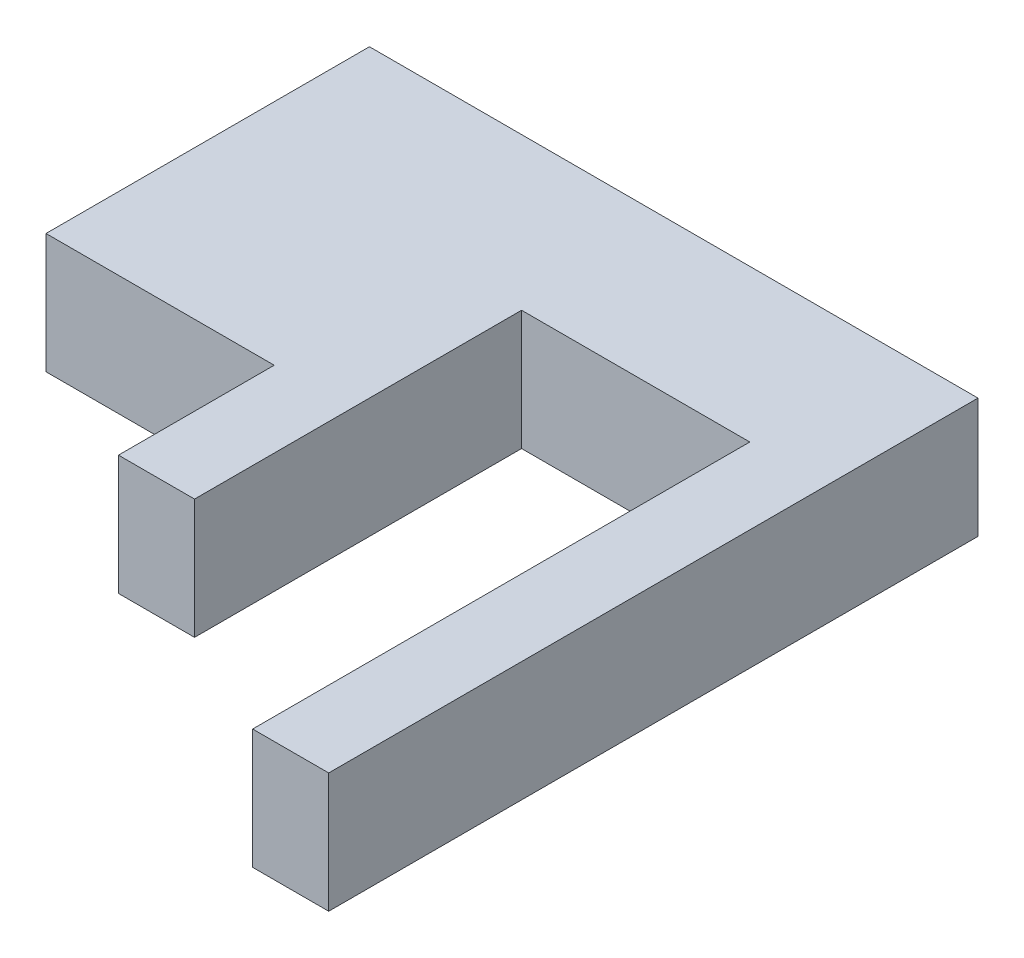
ISO-10303-21;
HEADER;
FILE_DESCRIPTION(('STEP AP214'),'2;1');
FILE_NAME('part.step','',(''),(''),'','','');
FILE_SCHEMA(('AUTOMOTIVE_DESIGN { 1 0 10303 214 1 1 1 1 }'));
ENDSEC;
DATA;
#1=APPLICATION_CONTEXT('core data for automotive mechanical design processes');
#2=APPLICATION_PROTOCOL_DEFINITION('international standard','automotive_design',2000,#1);
#3=PRODUCT_CONTEXT('',#1,'mechanical');
#4=PRODUCT('Part','Part','',(#3));
#5=PRODUCT_RELATED_PRODUCT_CATEGORY('part','',(#4));
#6=PRODUCT_DEFINITION_FORMATION('','',#4);
#7=PRODUCT_DEFINITION_CONTEXT('part definition',#1,'design');
#8=PRODUCT_DEFINITION('design','',#6,#7);
#9=PRODUCT_DEFINITION_SHAPE('','',#8);
#10=(LENGTH_UNIT() NAMED_UNIT(*) SI_UNIT(.MILLI.,.METRE.));
#11=(NAMED_UNIT(*) PLANE_ANGLE_UNIT() SI_UNIT($,.RADIAN.));
#12=(NAMED_UNIT(*) SI_UNIT($,.STERADIAN.) SOLID_ANGLE_UNIT());
#13=UNCERTAINTY_MEASURE_WITH_UNIT(LENGTH_MEASURE(1.E-05),#10,'distance_accuracy_value','');
#14=(GEOMETRIC_REPRESENTATION_CONTEXT(3) GLOBAL_UNCERTAINTY_ASSIGNED_CONTEXT((#13)) GLOBAL_UNIT_ASSIGNED_CONTEXT((#10,
#11,#12)) REPRESENTATION_CONTEXT('',''));
#15=CARTESIAN_POINT('',(0.,0.,0.));
#16=DIRECTION('',(0.,0.,1.));
#17=DIRECTION('',(1.,0.,0.));
#18=AXIS2_PLACEMENT_3D('',#15,#16,#17);
#19=CARTESIAN_POINT('',(-111.210993035549,10.,-33.624609368075));
#20=DIRECTION('',(1.,0.,0.));
#21=DIRECTION('',(0.,0.,-1.));
#22=AXIS2_PLACEMENT_3D('',#19,#20,#21);
#23=PLANE('',#22);
#24=DIRECTION('',(0.,0.,1.));
#25=VECTOR('',#24,1.);
#26=CARTESIAN_POINT('',(-111.210993035549,0.,-33.624609368075));
#27=LINE('',#26,#25);
#28=CARTESIAN_POINT('',(-111.210993035549,0.,-33.624609368075));
#29=VERTEX_POINT('',#28);
#30=CARTESIAN_POINT('',(-111.210993035549,0.,-6.62460936807503));
#31=VERTEX_POINT('',#30);
#32=EDGE_CURVE('E142',#29,#31,#27,.T.);
#33=ORIENTED_EDGE('',*,*,#32,.T.);
#34=DIRECTION('',(0.,-1.,0.));
#35=VECTOR('',#34,1.);
#36=CARTESIAN_POINT('',(-111.210993035549,10.,-6.62460936807503));
#37=LINE('',#36,#35);
#38=CARTESIAN_POINT('',(-111.210993035549,10.,-6.62460936807503));
#39=VERTEX_POINT('',#38);
#40=EDGE_CURVE('E11',#39,#31,#37,.T.);
#41=ORIENTED_EDGE('',*,*,#40,.F.);
#42=DIRECTION('',(0.,0.,1.));
#43=VECTOR('',#42,1.);
#44=CARTESIAN_POINT('',(-111.210993035549,10.,-33.624609368075));
#45=LINE('',#44,#43);
#46=CARTESIAN_POINT('',(-111.210993035549,10.,-33.624609368075));
#47=VERTEX_POINT('',#46);
#48=EDGE_CURVE('E161',#47,#39,#45,.T.);
#49=ORIENTED_EDGE('',*,*,#48,.F.);
#50=DIRECTION('',(0.,-1.,0.));
#51=VECTOR('',#50,1.);
#52=CARTESIAN_POINT('',(-111.210993035549,10.,-33.624609368075));
#53=LINE('',#52,#51);
#54=EDGE_CURVE('E138',#47,#29,#53,.T.);
#55=ORIENTED_EDGE('',*,*,#54,.T.);
#56=EDGE_LOOP('',(#33,#41,#49,#55));
#57=FACE_BOUND('',#56,.T.);
#58=ADVANCED_FACE('F33',(#57),#23,.F.);
#59=CARTESIAN_POINT('',(-111.210993035549,10.,-6.62460936807503));
#60=DIRECTION('',(0.,0.,-1.));
#61=DIRECTION('',(-1.,0.,0.));
#62=AXIS2_PLACEMENT_3D('',#59,#60,#61);
#63=PLANE('',#62);
#64=DIRECTION('',(1.,0.,0.));
#65=VECTOR('',#64,1.);
#66=CARTESIAN_POINT('',(-111.210993035549,0.,-6.62460936807503));
#67=LINE('',#66,#65);
#68=CARTESIAN_POINT('',(-92.1609930355495,0.,-6.62460936807503));
#69=VERTEX_POINT('',#68);
#70=EDGE_CURVE('E145',#31,#69,#67,.T.);
#71=ORIENTED_EDGE('',*,*,#70,.T.);
#72=DIRECTION('',(0.,-1.,0.));
#73=VECTOR('',#72,1.);
#74=CARTESIAN_POINT('',(-92.1609930355495,10.,-6.62460936807503));
#75=LINE('',#74,#73);
#76=CARTESIAN_POINT('',(-92.1609930355495,10.,-6.62460936807503));
#77=VERTEX_POINT('',#76);
#78=EDGE_CURVE('E41',#77,#69,#75,.T.);
#79=ORIENTED_EDGE('',*,*,#78,.F.);
#80=DIRECTION('',(1.,0.,0.));
#81=VECTOR('',#80,1.);
#82=CARTESIAN_POINT('',(-111.210993035549,10.,-6.62460936807503));
#83=LINE('',#82,#81);
#84=EDGE_CURVE('E95',#39,#77,#83,.T.);
#85=ORIENTED_EDGE('',*,*,#84,.F.);
#86=ORIENTED_EDGE('',*,*,#40,.T.);
#87=EDGE_LOOP('',(#71,#79,#85,#86));
#88=FACE_BOUND('',#87,.T.);
#89=ADVANCED_FACE('F208',(#88),#63,.F.);
#90=CARTESIAN_POINT('',(-92.1609930355495,10.,6.37539063192497));
#91=DIRECTION('',(1.,0.,0.));
#92=DIRECTION('',(0.,0.,-1.));
#93=AXIS2_PLACEMENT_3D('',#90,#91,#92);
#94=PLANE('',#93);
#95=DIRECTION('',(0.,0.,1.));
#96=VECTOR('',#95,1.);
#97=CARTESIAN_POINT('',(-92.1609930355495,0.,6.37539063192497));
#98=LINE('',#97,#96);
#99=CARTESIAN_POINT('',(-92.1609930355495,0.,6.37539063192497));
#100=VERTEX_POINT('',#99);
#101=EDGE_CURVE('E147',#69,#100,#98,.T.);
#102=ORIENTED_EDGE('',*,*,#101,.T.);
#103=DIRECTION('',(0.,-1.,0.));
#104=VECTOR('',#103,1.);
#105=CARTESIAN_POINT('',(-92.1609930355495,10.,6.37539063192497));
#106=LINE('',#105,#104);
#107=CARTESIAN_POINT('',(-92.1609930355495,10.,6.37539063192497));
#108=VERTEX_POINT('',#107);
#109=EDGE_CURVE('E174',#108,#100,#106,.T.);
#110=ORIENTED_EDGE('',*,*,#109,.F.);
#111=DIRECTION('',(0.,0.,1.));
#112=VECTOR('',#111,1.);
#113=CARTESIAN_POINT('',(-92.1609930355495,10.,6.37539063192497));
#114=LINE('',#113,#112);
#115=EDGE_CURVE('E182',#77,#108,#114,.T.);
#116=ORIENTED_EDGE('',*,*,#115,.F.);
#117=ORIENTED_EDGE('',*,*,#78,.T.);
#118=EDGE_LOOP('',(#102,#110,#116,#117));
#119=FACE_BOUND('',#118,.T.);
#120=ADVANCED_FACE('F180',(#119),#94,.F.);
#121=CARTESIAN_POINT('',(-92.1609930355495,10.,6.37539063192497));
#122=DIRECTION('',(0.,0.,-1.));
#123=DIRECTION('',(-1.,0.,0.));
#124=AXIS2_PLACEMENT_3D('',#121,#122,#123);
#125=PLANE('',#124);
#126=DIRECTION('',(1.,0.,0.));
#127=VECTOR('',#126,1.);
#128=CARTESIAN_POINT('',(-92.1609930355495,0.,6.37539063192497));
#129=LINE('',#128,#127);
#130=CARTESIAN_POINT('',(-85.8109930355495,0.,6.37539063192497));
#131=VERTEX_POINT('',#130);
#132=EDGE_CURVE('E149',#100,#131,#129,.T.);
#133=ORIENTED_EDGE('',*,*,#132,.T.);
#134=DIRECTION('',(0.,-1.,0.));
#135=VECTOR('',#134,1.);
#136=CARTESIAN_POINT('',(-85.8109930355495,10.,6.37539063192497));
#137=LINE('',#136,#135);
#138=CARTESIAN_POINT('',(-85.8109930355495,10.,6.37539063192497));
#139=VERTEX_POINT('',#138);
#140=EDGE_CURVE('E171',#139,#131,#137,.T.);
#141=ORIENTED_EDGE('',*,*,#140,.F.);
#142=DIRECTION('',(1.,0.,0.));
#143=VECTOR('',#142,1.);
#144=CARTESIAN_POINT('',(-92.1609930355495,10.,6.37539063192497));
#145=LINE('',#144,#143);
#146=EDGE_CURVE('E198',#108,#139,#145,.T.);
#147=ORIENTED_EDGE('',*,*,#146,.F.);
#148=ORIENTED_EDGE('',*,*,#109,.T.);
#149=EDGE_LOOP('',(#133,#141,#147,#148));
#150=FACE_BOUND('',#149,.T.);
#151=ADVANCED_FACE('F189',(#150),#125,.F.);
#152=CARTESIAN_POINT('',(-85.8109930355495,10.,-20.924609368075));
#153=DIRECTION('',(-1.,0.,0.));
#154=DIRECTION('',(0.,0.,1.));
#155=AXIS2_PLACEMENT_3D('',#152,#153,#154);
#156=PLANE('',#155);
#157=DIRECTION('',(0.,0.,-1.));
#158=VECTOR('',#157,1.);
#159=CARTESIAN_POINT('',(-85.8109930355495,0.,-20.924609368075));
#160=LINE('',#159,#158);
#161=CARTESIAN_POINT('',(-85.8109930355495,0.,-20.924609368075));
#162=VERTEX_POINT('',#161);
#163=EDGE_CURVE('E151',#131,#162,#160,.T.);
#164=ORIENTED_EDGE('',*,*,#163,.T.);
#165=DIRECTION('',(0.,-1.,0.));
#166=VECTOR('',#165,1.);
#167=CARTESIAN_POINT('',(-85.8109930355495,10.,-20.924609368075));
#168=LINE('',#167,#166);
#169=CARTESIAN_POINT('',(-85.8109930355495,10.,-20.924609368075));
#170=VERTEX_POINT('',#169);
#171=EDGE_CURVE('E168',#170,#162,#168,.T.);
#172=ORIENTED_EDGE('',*,*,#171,.F.);
#173=DIRECTION('',(0.,0.,-1.));
#174=VECTOR('',#173,1.);
#175=CARTESIAN_POINT('',(-85.8109930355495,10.,-20.924609368075));
#176=LINE('',#175,#174);
#177=EDGE_CURVE('E195',#139,#170,#176,.T.);
#178=ORIENTED_EDGE('',*,*,#177,.F.);
#179=ORIENTED_EDGE('',*,*,#140,.T.);
#180=EDGE_LOOP('',(#164,#172,#178,#179));
#181=FACE_BOUND('',#180,.T.);
#182=ADVANCED_FACE('F193',(#181),#156,.F.);
#183=CARTESIAN_POINT('',(-85.8109930355495,10.,-20.924609368075));
#184=DIRECTION('',(0.,0.,-1.));
#185=DIRECTION('',(-1.,0.,0.));
#186=AXIS2_PLACEMENT_3D('',#183,#184,#185);
#187=PLANE('',#186);
#188=DIRECTION('',(1.,0.,0.));
#189=VECTOR('',#188,1.);
#190=CARTESIAN_POINT('',(-85.8109930355495,0.,-20.924609368075));
#191=LINE('',#190,#189);
#192=CARTESIAN_POINT('',(-66.7609930355495,0.,-20.924609368075));
#193=VERTEX_POINT('',#192);
#194=EDGE_CURVE('E153',#162,#193,#191,.T.);
#195=ORIENTED_EDGE('',*,*,#194,.T.);
#196=DIRECTION('',(0.,-1.,0.));
#197=VECTOR('',#196,1.);
#198=CARTESIAN_POINT('',(-66.7609930355495,10.,-20.924609368075));
#199=LINE('',#198,#197);
#200=CARTESIAN_POINT('',(-66.7609930355495,10.,-20.924609368075));
#201=VERTEX_POINT('',#200);
#202=EDGE_CURVE('E165',#201,#193,#199,.T.);
#203=ORIENTED_EDGE('',*,*,#202,.F.);
#204=DIRECTION('',(1.,0.,0.));
#205=VECTOR('',#204,1.);
#206=CARTESIAN_POINT('',(-85.8109930355495,10.,-20.924609368075));
#207=LINE('',#206,#205);
#208=EDGE_CURVE('E197',#170,#201,#207,.T.);
#209=ORIENTED_EDGE('',*,*,#208,.F.);
#210=ORIENTED_EDGE('',*,*,#171,.T.);
#211=EDGE_LOOP('',(#195,#203,#209,#210));
#212=FACE_BOUND('',#211,.T.);
#213=ADVANCED_FACE('F220',(#212),#187,.F.);
#214=CARTESIAN_POINT('',(-66.7609930355495,10.,-20.924609368075));
#215=DIRECTION('',(1.,0.,0.));
#216=DIRECTION('',(0.,0.,-1.));
#217=AXIS2_PLACEMENT_3D('',#214,#215,#216);
#218=PLANE('',#217);
#219=DIRECTION('',(0.,0.,1.));
#220=VECTOR('',#219,1.);
#221=CARTESIAN_POINT('',(-66.7609930355495,0.,-20.924609368075));
#222=LINE('',#221,#220);
#223=CARTESIAN_POINT('',(-66.7609930355495,0.,20.575390631925));
#224=VERTEX_POINT('',#223);
#225=EDGE_CURVE('E155',#193,#224,#222,.T.);
#226=ORIENTED_EDGE('',*,*,#225,.T.);
#227=DIRECTION('',(0.,-1.,0.));
#228=VECTOR('',#227,1.);
#229=CARTESIAN_POINT('',(-66.7609930355495,10.,20.575390631925));
#230=LINE('',#229,#228);
#231=CARTESIAN_POINT('',(-66.7609930355495,10.,20.575390631925));
#232=VERTEX_POINT('',#231);
#233=EDGE_CURVE('E133',#232,#224,#230,.T.);
#234=ORIENTED_EDGE('',*,*,#233,.F.);
#235=DIRECTION('',(0.,0.,1.));
#236=VECTOR('',#235,1.);
#237=CARTESIAN_POINT('',(-66.7609930355495,10.,-20.924609368075));
#238=LINE('',#237,#236);
#239=EDGE_CURVE('E121',#201,#232,#238,.T.);
#240=ORIENTED_EDGE('',*,*,#239,.F.);
#241=ORIENTED_EDGE('',*,*,#202,.T.);
#242=EDGE_LOOP('',(#226,#234,#240,#241));
#243=FACE_BOUND('',#242,.T.);
#244=ADVANCED_FACE('F223',(#243),#218,.F.);
#245=CARTESIAN_POINT('',(-66.7609930355495,10.,20.575390631925));
#246=DIRECTION('',(0.,0.,-1.));
#247=DIRECTION('',(-1.,0.,0.));
#248=AXIS2_PLACEMENT_3D('',#245,#246,#247);
#249=PLANE('',#248);
#250=DIRECTION('',(1.,0.,0.));
#251=VECTOR('',#250,1.);
#252=CARTESIAN_POINT('',(-66.7609930355495,0.,20.575390631925));
#253=LINE('',#252,#251);
#254=CARTESIAN_POINT('',(-60.4109930355495,0.,20.575390631925));
#255=VERTEX_POINT('',#254);
#256=EDGE_CURVE('E131',#224,#255,#253,.T.);
#257=ORIENTED_EDGE('',*,*,#256,.T.);
#258=DIRECTION('',(0.,-1.,0.));
#259=VECTOR('',#258,1.);
#260=CARTESIAN_POINT('',(-60.4109930355495,10.,20.575390631925));
#261=LINE('',#260,#259);
#262=CARTESIAN_POINT('',(-60.4109930355495,10.,20.575390631925));
#263=VERTEX_POINT('',#262);
#264=EDGE_CURVE('E128',#263,#255,#261,.T.);
#265=ORIENTED_EDGE('',*,*,#264,.F.);
#266=DIRECTION('',(1.,0.,0.));
#267=VECTOR('',#266,1.);
#268=CARTESIAN_POINT('',(-66.7609930355495,10.,20.575390631925));
#269=LINE('',#268,#267);
#270=EDGE_CURVE('E114',#232,#263,#269,.T.);
#271=ORIENTED_EDGE('',*,*,#270,.F.);
#272=ORIENTED_EDGE('',*,*,#233,.T.);
#273=EDGE_LOOP('',(#257,#265,#271,#272));
#274=FACE_BOUND('',#273,.T.);
#275=ADVANCED_FACE('F129',(#274),#249,.F.);
#276=CARTESIAN_POINT('',(-60.4109930355495,10.,-33.624609368075));
#277=DIRECTION('',(-1.,0.,0.));
#278=DIRECTION('',(0.,0.,1.));
#279=AXIS2_PLACEMENT_3D('',#276,#277,#278);
#280=PLANE('',#279);
#281=DIRECTION('',(0.,0.,-1.));
#282=VECTOR('',#281,1.);
#283=CARTESIAN_POINT('',(-60.4109930355495,0.,-33.624609368075));
#284=LINE('',#283,#282);
#285=CARTESIAN_POINT('',(-60.4109930355495,0.,-33.624609368075));
#286=VERTEX_POINT('',#285);
#287=EDGE_CURVE('E158',#255,#286,#284,.T.);
#288=ORIENTED_EDGE('',*,*,#287,.T.);
#289=DIRECTION('',(0.,-1.,0.));
#290=VECTOR('',#289,1.);
#291=CARTESIAN_POINT('',(-60.4109930355495,10.,-33.624609368075));
#292=LINE('',#291,#290);
#293=CARTESIAN_POINT('',(-60.4109930355495,10.,-33.624609368075));
#294=VERTEX_POINT('',#293);
#295=EDGE_CURVE('E134',#294,#286,#292,.T.);
#296=ORIENTED_EDGE('',*,*,#295,.F.);
#297=DIRECTION('',(0.,0.,-1.));
#298=VECTOR('',#297,1.);
#299=CARTESIAN_POINT('',(-60.4109930355495,10.,-31.8868542056569));
#300=LINE('',#299,#298);
#301=EDGE_CURVE('E118',#263,#294,#300,.T.);
#302=ORIENTED_EDGE('',*,*,#301,.F.);
#303=ORIENTED_EDGE('',*,*,#264,.T.);
#304=EDGE_LOOP('',(#288,#296,#302,#303));
#305=FACE_BOUND('',#304,.T.);
#306=ADVANCED_FACE('F136',(#305),#280,.F.);
#307=CARTESIAN_POINT('',(-111.210993035549,10.,-33.624609368075));
#308=DIRECTION('',(0.,0.,1.));
#309=DIRECTION('',(1.,0.,0.));
#310=AXIS2_PLACEMENT_3D('',#307,#308,#309);
#311=PLANE('',#310);
#312=DIRECTION('',(-1.,0.,0.));
#313=VECTOR('',#312,1.);
#314=CARTESIAN_POINT('',(-111.210993035549,0.,-33.624609368075));
#315=LINE('',#314,#313);
#316=EDGE_CURVE('E83',#286,#29,#315,.T.);
#317=ORIENTED_EDGE('',*,*,#316,.T.);
#318=ORIENTED_EDGE('',*,*,#54,.F.);
#319=DIRECTION('',(-1.,0.,0.));
#320=VECTOR('',#319,1.);
#321=CARTESIAN_POINT('',(-85.8109930355495,10.,-33.624609368075));
#322=LINE('',#321,#320);
#323=EDGE_CURVE('E49',#294,#47,#322,.T.);
#324=ORIENTED_EDGE('',*,*,#323,.F.);
#325=ORIENTED_EDGE('',*,*,#295,.T.);
#326=EDGE_LOOP('',(#317,#318,#324,#325));
#327=FACE_BOUND('',#326,.T.);
#328=ADVANCED_FACE('F232',(#327),#311,.F.);
#329=CARTESIAN_POINT('',(0.,10.,0.));
#330=DIRECTION('',(0.,1.,0.));
#331=DIRECTION('',(0.,0.,1.));
#332=AXIS2_PLACEMENT_3D('',#329,#330,#331);
#333=PLANE('',#332);
#334=ORIENTED_EDGE('',*,*,#48,.T.);
#335=ORIENTED_EDGE('',*,*,#84,.T.);
#336=ORIENTED_EDGE('',*,*,#115,.T.);
#337=ORIENTED_EDGE('',*,*,#146,.T.);
#338=ORIENTED_EDGE('',*,*,#177,.T.);
#339=ORIENTED_EDGE('',*,*,#208,.T.);
#340=ORIENTED_EDGE('',*,*,#239,.T.);
#341=ORIENTED_EDGE('',*,*,#270,.T.);
#342=ORIENTED_EDGE('',*,*,#301,.T.);
#343=ORIENTED_EDGE('',*,*,#323,.T.);
#344=EDGE_LOOP('',(#334,#335,#336,#337,#338,#339,#340,#341,#342,#343));
#345=FACE_BOUND('',#344,.T.);
#346=ADVANCED_FACE('F116',(#345),#333,.T.);
#347=CARTESIAN_POINT('',(0.,0.,0.));
#348=DIRECTION('',(0.,1.,0.));
#349=DIRECTION('',(0.,0.,1.));
#350=AXIS2_PLACEMENT_3D('',#347,#348,#349);
#351=PLANE('',#350);
#352=ORIENTED_EDGE('',*,*,#32,.F.);
#353=ORIENTED_EDGE('',*,*,#316,.F.);
#354=ORIENTED_EDGE('',*,*,#287,.F.);
#355=ORIENTED_EDGE('',*,*,#256,.F.);
#356=ORIENTED_EDGE('',*,*,#225,.F.);
#357=ORIENTED_EDGE('',*,*,#194,.F.);
#358=ORIENTED_EDGE('',*,*,#163,.F.);
#359=ORIENTED_EDGE('',*,*,#132,.F.);
#360=ORIENTED_EDGE('',*,*,#101,.F.);
#361=ORIENTED_EDGE('',*,*,#70,.F.);
#362=EDGE_LOOP('',(#352,#353,#354,#355,#356,#357,#358,#359,#360,#361));
#363=FACE_BOUND('',#362,.T.);
#364=ADVANCED_FACE('F184',(#363),#351,.F.);
#365=CLOSED_SHELL('',(#58,#89,#120,#151,#182,#213,#244,#275,#306,#328,#346,#364));
#366=MANIFOLD_SOLID_BREP('B2',#365);
#367=ADVANCED_BREP_SHAPE_REPRESENTATION('',(#18,#366),#14);
#368=SHAPE_DEFINITION_REPRESENTATION(#9,#367);
ENDSEC;
END-ISO-10303-21;
